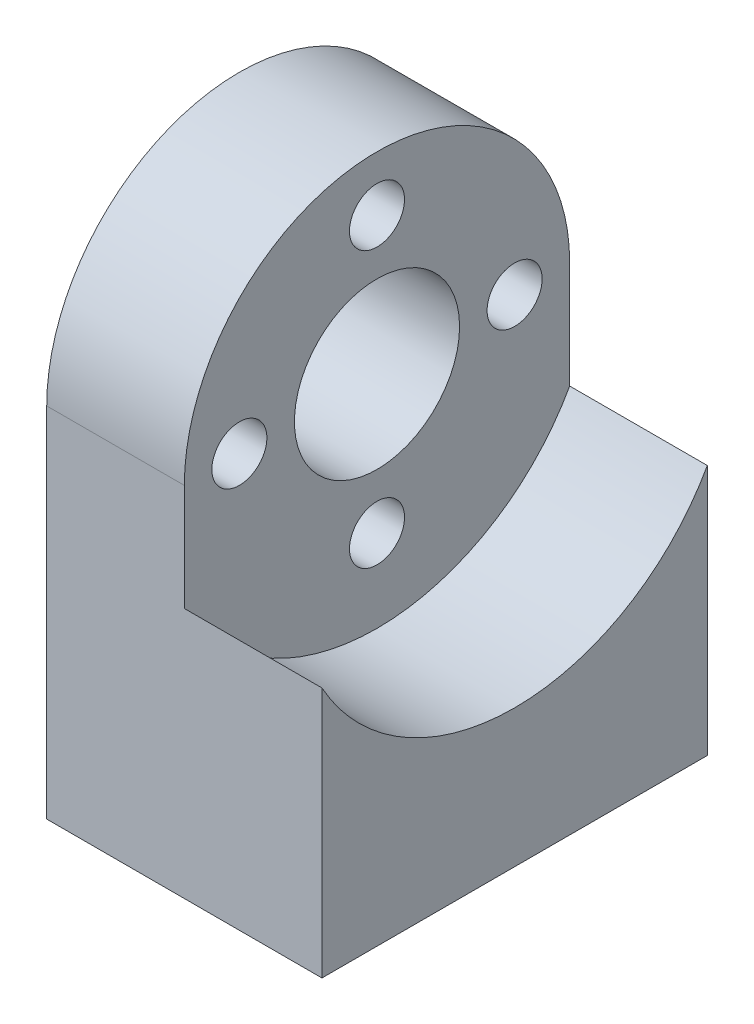
ISO-10303-21;
HEADER;
FILE_DESCRIPTION(('STEP AP214'),'2;1');
FILE_NAME('part.step','',(''),(''),'','','');
FILE_SCHEMA(('AUTOMOTIVE_DESIGN { 1 0 10303 214 1 1 1 1 }'));
ENDSEC;
DATA;
#1=APPLICATION_CONTEXT('core data for automotive mechanical design processes');
#2=APPLICATION_PROTOCOL_DEFINITION('international standard','automotive_design',2000,#1);
#3=PRODUCT_CONTEXT('',#1,'mechanical');
#4=PRODUCT('Part','Part','',(#3));
#5=PRODUCT_RELATED_PRODUCT_CATEGORY('part','',(#4));
#6=PRODUCT_DEFINITION_FORMATION('','',#4);
#7=PRODUCT_DEFINITION_CONTEXT('part definition',#1,'design');
#8=PRODUCT_DEFINITION('design','',#6,#7);
#9=PRODUCT_DEFINITION_SHAPE('','',#8);
#10=(LENGTH_UNIT() NAMED_UNIT(*) SI_UNIT(.MILLI.,.METRE.));
#11=(NAMED_UNIT(*) PLANE_ANGLE_UNIT() SI_UNIT($,.RADIAN.));
#12=(NAMED_UNIT(*) SI_UNIT($,.STERADIAN.) SOLID_ANGLE_UNIT());
#13=UNCERTAINTY_MEASURE_WITH_UNIT(LENGTH_MEASURE(1.E-05),#10,'distance_accuracy_value','');
#14=(GEOMETRIC_REPRESENTATION_CONTEXT(3) GLOBAL_UNCERTAINTY_ASSIGNED_CONTEXT((#13)) GLOBAL_UNIT_ASSIGNED_CONTEXT((#10,
#11,#12)) REPRESENTATION_CONTEXT('',''));
#15=CARTESIAN_POINT('',(0.,0.,0.));
#16=DIRECTION('',(0.,0.,1.));
#17=DIRECTION('',(1.,0.,0.));
#18=AXIS2_PLACEMENT_3D('',#15,#16,#17);
#19=CARTESIAN_POINT('',(0.,13.,-7.));
#20=DIRECTION('',(-1.,0.,0.));
#21=DIRECTION('',(0.,0.,1.));
#22=AXIS2_PLACEMENT_3D('',#19,#20,#21);
#23=PLANE('',#22);
#24=CARTESIAN_POINT('',(0.,13.,-7.));
#25=DIRECTION('',(1.,0.,0.));
#26=DIRECTION('',(0.,0.,1.));
#27=AXIS2_PLACEMENT_3D('',#24,#25,#26);
#28=CIRCLE('',#27,7.);
#29=CARTESIAN_POINT('',(0.,13.,-14.));
#30=VERTEX_POINT('',#29);
#31=CARTESIAN_POINT('',(0.,20.,-6.99999999999998));
#32=VERTEX_POINT('',#31);
#33=EDGE_CURVE('E161',#30,#32,#28,.T.);
#34=ORIENTED_EDGE('',*,*,#33,.F.);
#35=CARTESIAN_POINT('',(0.,13.,-12.));
#36=DIRECTION('',(-1.,0.,0.));
#37=DIRECTION('',(0.,0.,1.));
#38=AXIS2_PLACEMENT_3D('',#35,#36,#37);
#39=CIRCLE('',#38,2.00000000000001);
#40=CARTESIAN_POINT('',(0.,13.,-10.));
#41=VERTEX_POINT('',#40);
#42=EDGE_CURVE('E206',#30,#41,#39,.F.);
#43=ORIENTED_EDGE('',*,*,#42,.T.);
#44=CARTESIAN_POINT('',(0.,13.,-7.));
#45=DIRECTION('',(1.,0.,0.));
#46=DIRECTION('',(0.,0.,-1.));
#47=AXIS2_PLACEMENT_3D('',#44,#45,#46);
#48=CIRCLE('',#47,3.);
#49=CARTESIAN_POINT('',(0.,16.,-6.99999999999999));
#50=VERTEX_POINT('',#49);
#51=EDGE_CURVE('E148',#41,#50,#48,.T.);
#52=ORIENTED_EDGE('',*,*,#51,.T.);
#53=CARTESIAN_POINT('',(0.,18.,-6.99999999999999));
#54=DIRECTION('',(-1.,0.,0.));
#55=DIRECTION('',(0.,0.,1.));
#56=AXIS2_PLACEMENT_3D('',#53,#54,#55);
#57=CIRCLE('',#56,2.00000000000001);
#58=EDGE_CURVE('E50',#50,#32,#57,.F.);
#59=ORIENTED_EDGE('',*,*,#58,.T.);
#60=EDGE_LOOP('',(#34,#43,#52,#59));
#61=FACE_BOUND('',#60,.T.);
#62=ADVANCED_FACE('F35',(#61),#23,.T.);
#63=CARTESIAN_POINT('',(0.,13.,-4.));
#64=VERTEX_POINT('',#63);
#65=CARTESIAN_POINT('',(0.,10.,-7.00000000000003));
#66=VERTEX_POINT('',#65);
#67=EDGE_CURVE('E234',#64,#66,#48,.T.);
#68=ORIENTED_EDGE('',*,*,#67,.T.);
#69=CARTESIAN_POINT('',(0.,8.,-7.00000000000005));
#70=DIRECTION('',(-1.,0.,0.));
#71=DIRECTION('',(0.,0.,1.));
#72=AXIS2_PLACEMENT_3D('',#69,#70,#71);
#73=CIRCLE('',#72,2.00000000000001);
#74=EDGE_CURVE('E56',#66,#66,#73,.F.);
#75=ORIENTED_EDGE('',*,*,#74,.T.);
#76=EDGE_CURVE('E147',#66,#41,#48,.T.);
#77=ORIENTED_EDGE('',*,*,#76,.T.);
#78=CARTESIAN_POINT('',(0.,13.,-12.));
#79=DIRECTION('',(-1.,0.,0.));
#80=DIRECTION('',(0.,0.,1.));
#81=AXIS2_PLACEMENT_3D('',#78,#79,#80);
#82=CIRCLE('',#81,2.00000000000001);
#83=EDGE_CURVE('E204',#41,#30,#82,.F.);
#84=ORIENTED_EDGE('',*,*,#83,.T.);
#85=DIRECTION('',(0.,1.,0.));
#86=VECTOR('',#85,1.);
#87=CARTESIAN_POINT('',(0.,0.,-14.));
#88=LINE('',#87,#86);
#89=CARTESIAN_POINT('',(0.,0.,-14.));
#90=VERTEX_POINT('',#89);
#91=EDGE_CURVE('E155',#90,#30,#88,.T.);
#92=ORIENTED_EDGE('',*,*,#91,.F.);
#93=DIRECTION('',(0.,0.,-1.));
#94=VECTOR('',#93,1.);
#95=CARTESIAN_POINT('',(0.,0.,0.));
#96=LINE('',#95,#94);
#97=CARTESIAN_POINT('',(0.,0.,0.));
#98=VERTEX_POINT('',#97);
#99=EDGE_CURVE('E166',#98,#90,#96,.T.);
#100=ORIENTED_EDGE('',*,*,#99,.F.);
#101=DIRECTION('',(0.,-1.,0.));
#102=VECTOR('',#101,1.);
#103=CARTESIAN_POINT('',(0.,13.,0.));
#104=LINE('',#103,#102);
#105=CARTESIAN_POINT('',(0.,13.,0.));
#106=VERTEX_POINT('',#105);
#107=EDGE_CURVE('E164',#106,#98,#104,.T.);
#108=ORIENTED_EDGE('',*,*,#107,.F.);
#109=CARTESIAN_POINT('',(0.,13.,-2.));
#110=DIRECTION('',(-1.,0.,0.));
#111=DIRECTION('',(0.,0.,1.));
#112=AXIS2_PLACEMENT_3D('',#109,#110,#111);
#113=CIRCLE('',#112,2.00000000000001);
#114=EDGE_CURVE('E201',#106,#64,#113,.F.);
#115=ORIENTED_EDGE('',*,*,#114,.T.);
#116=EDGE_LOOP('',(#68,#75,#77,#84,#92,#100,#108,#115));
#117=FACE_BOUND('',#116,.T.);
#118=ADVANCED_FACE('F233',(#117),#23,.T.);
#119=CARTESIAN_POINT('',(10.,8.,-7.00000000000005));
#120=DIRECTION('',(-1.,0.,0.));
#121=DIRECTION('',(0.,1.,0.));
#122=AXIS2_PLACEMENT_3D('',#119,#120,#121);
#123=CYLINDRICAL_SURFACE('',#122,1.);
#124=CARTESIAN_POINT('',(1.,8.,-7.00000000000005));
#125=DIRECTION('',(-1.,0.,0.));
#126=DIRECTION('',(0.,0.,1.));
#127=AXIS2_PLACEMENT_3D('',#124,#125,#126);
#128=CIRCLE('',#127,1.);
#129=CARTESIAN_POINT('',(1.,8.,-6.00000000000005));
#130=VERTEX_POINT('',#129);
#131=EDGE_CURVE('E210',#130,#130,#128,.T.);
#132=ORIENTED_EDGE('',*,*,#131,.T.);
#133=EDGE_LOOP('',(#132));
#134=FACE_BOUND('',#133,.T.);
#135=CARTESIAN_POINT('',(5.,8.,-7.00000000000005));
#136=DIRECTION('',(1.,0.,0.));
#137=DIRECTION('',(0.,-1.,0.));
#138=AXIS2_PLACEMENT_3D('',#135,#136,#137);
#139=CIRCLE('',#138,1.);
#140=CARTESIAN_POINT('',(5.,6.99999999999999,-7.00000000000006));
#141=VERTEX_POINT('',#140);
#142=EDGE_CURVE('E192',#141,#141,#139,.T.);
#143=ORIENTED_EDGE('',*,*,#142,.T.);
#144=EDGE_LOOP('',(#143));
#145=FACE_BOUND('',#144,.T.);
#146=ADVANCED_FACE('F256',(#134,#145),#123,.F.);
#147=CARTESIAN_POINT('',(10.,13.,-2.));
#148=DIRECTION('',(-1.,0.,0.));
#149=DIRECTION('',(0.,0.,-1.));
#150=AXIS2_PLACEMENT_3D('',#147,#148,#149);
#151=CYLINDRICAL_SURFACE('',#150,1.);
#152=CARTESIAN_POINT('',(1.,13.,-2.));
#153=DIRECTION('',(-1.,0.,0.));
#154=DIRECTION('',(0.,0.,1.));
#155=AXIS2_PLACEMENT_3D('',#152,#153,#154);
#156=CIRCLE('',#155,1.);
#157=CARTESIAN_POINT('',(1.,13.,-0.999999999999999));
#158=VERTEX_POINT('',#157);
#159=EDGE_CURVE('E43',#158,#158,#156,.T.);
#160=ORIENTED_EDGE('',*,*,#159,.T.);
#161=EDGE_LOOP('',(#160));
#162=FACE_BOUND('',#161,.T.);
#163=CARTESIAN_POINT('',(5.,13.,-2.));
#164=DIRECTION('',(1.,0.,0.));
#165=DIRECTION('',(0.,0.,1.));
#166=AXIS2_PLACEMENT_3D('',#163,#164,#165);
#167=CIRCLE('',#166,1.);
#168=CARTESIAN_POINT('',(5.,13.,-0.999999999999999));
#169=VERTEX_POINT('',#168);
#170=EDGE_CURVE('E189',#169,#169,#167,.T.);
#171=ORIENTED_EDGE('',*,*,#170,.T.);
#172=EDGE_LOOP('',(#171));
#173=FACE_BOUND('',#172,.T.);
#174=ADVANCED_FACE('F218',(#162,#173),#151,.F.);
#175=CARTESIAN_POINT('',(10.,18.,-6.99999999999999));
#176=DIRECTION('',(-1.,0.,0.));
#177=DIRECTION('',(0.,-1.,0.));
#178=AXIS2_PLACEMENT_3D('',#175,#176,#177);
#179=CYLINDRICAL_SURFACE('',#178,1.);
#180=CARTESIAN_POINT('',(1.,18.,-6.99999999999999));
#181=DIRECTION('',(-1.,0.,0.));
#182=DIRECTION('',(0.,0.,1.));
#183=AXIS2_PLACEMENT_3D('',#180,#181,#182);
#184=CIRCLE('',#183,1.);
#185=CARTESIAN_POINT('',(1.,18.,-5.99999999999998));
#186=VERTEX_POINT('',#185);
#187=EDGE_CURVE('E11',#186,#186,#184,.T.);
#188=ORIENTED_EDGE('',*,*,#187,.T.);
#189=EDGE_LOOP('',(#188));
#190=FACE_BOUND('',#189,.T.);
#191=CARTESIAN_POINT('',(5.,18.,-6.99999999999999));
#192=DIRECTION('',(1.,0.,0.));
#193=DIRECTION('',(0.,1.,0.));
#194=AXIS2_PLACEMENT_3D('',#191,#192,#193);
#195=CIRCLE('',#194,1.);
#196=CARTESIAN_POINT('',(5.,19.,-6.99999999999998));
#197=VERTEX_POINT('',#196);
#198=EDGE_CURVE('E186',#197,#197,#195,.T.);
#199=ORIENTED_EDGE('',*,*,#198,.T.);
#200=EDGE_LOOP('',(#199));
#201=FACE_BOUND('',#200,.T.);
#202=ADVANCED_FACE('F373',(#190,#201),#179,.F.);
#203=CARTESIAN_POINT('',(10.,13.,-7.));
#204=DIRECTION('',(-1.,0.,0.));
#205=DIRECTION('',(0.,0.,1.));
#206=AXIS2_PLACEMENT_3D('',#203,#204,#205);
#207=CYLINDRICAL_SURFACE('',#206,7.);
#208=CARTESIAN_POINT('',(5.,13.,-7.));
#209=DIRECTION('',(1.,0.,0.));
#210=DIRECTION('',(0.,0.,-1.));
#211=AXIS2_PLACEMENT_3D('',#208,#209,#210);
#212=CIRCLE('',#211,7.);
#213=CARTESIAN_POINT('',(5.,13.,-14.));
#214=VERTEX_POINT('',#213);
#215=CARTESIAN_POINT('',(5.,13.,0.));
#216=VERTEX_POINT('',#215);
#217=EDGE_CURVE('E140',#214,#216,#212,.T.);
#218=ORIENTED_EDGE('',*,*,#217,.F.);
#219=DIRECTION('',(-1.,0.,0.));
#220=VECTOR('',#219,1.);
#221=CARTESIAN_POINT('',(10.,13.,-14.));
#222=LINE('',#221,#220);
#223=EDGE_CURVE('E160',#214,#30,#222,.T.);
#224=ORIENTED_EDGE('',*,*,#223,.T.);
#225=ORIENTED_EDGE('',*,*,#33,.T.);
#226=EDGE_CURVE('E150',#32,#106,#28,.T.);
#227=ORIENTED_EDGE('',*,*,#226,.T.);
#228=DIRECTION('',(-1.,0.,0.));
#229=VECTOR('',#228,1.);
#230=CARTESIAN_POINT('',(10.,13.,0.));
#231=LINE('',#230,#229);
#232=EDGE_CURVE('E178',#216,#106,#231,.T.);
#233=ORIENTED_EDGE('',*,*,#232,.F.);
#234=EDGE_LOOP('',(#218,#224,#225,#227,#233));
#235=FACE_BOUND('',#234,.T.);
#236=ADVANCED_FACE('F278',(#235),#207,.T.);
#237=CARTESIAN_POINT('',(10.,13.,-7.));
#238=DIRECTION('',(-1.,0.,0.));
#239=DIRECTION('',(0.,0.,1.));
#240=AXIS2_PLACEMENT_3D('',#237,#238,#239);
#241=CYLINDRICAL_SURFACE('',#240,3.);
#242=ORIENTED_EDGE('',*,*,#51,.F.);
#243=ORIENTED_EDGE('',*,*,#76,.F.);
#244=ORIENTED_EDGE('',*,*,#67,.F.);
#245=EDGE_CURVE('E151',#50,#64,#48,.T.);
#246=ORIENTED_EDGE('',*,*,#245,.F.);
#247=EDGE_LOOP('',(#242,#243,#244,#246));
#248=FACE_BOUND('',#247,.T.);
#249=CARTESIAN_POINT('',(5.,13.,-7.));
#250=DIRECTION('',(1.,0.,0.));
#251=DIRECTION('',(0.,0.,-1.));
#252=AXIS2_PLACEMENT_3D('',#249,#250,#251);
#253=CIRCLE('',#252,3.);
#254=CARTESIAN_POINT('',(5.,13.,-10.));
#255=VERTEX_POINT('',#254);
#256=EDGE_CURVE('E135',#255,#255,#253,.T.);
#257=ORIENTED_EDGE('',*,*,#256,.T.);
#258=EDGE_LOOP('',(#257));
#259=FACE_BOUND('',#258,.T.);
#260=ADVANCED_FACE('F240',(#248,#259),#241,.F.);
#261=CARTESIAN_POINT('',(10.,13.,-12.));
#262=DIRECTION('',(-1.,0.,0.));
#263=DIRECTION('',(0.,0.,1.));
#264=AXIS2_PLACEMENT_3D('',#261,#262,#263);
#265=CYLINDRICAL_SURFACE('',#264,1.);
#266=CARTESIAN_POINT('',(1.,13.,-12.));
#267=DIRECTION('',(-1.,0.,0.));
#268=DIRECTION('',(0.,0.,1.));
#269=AXIS2_PLACEMENT_3D('',#266,#267,#268);
#270=CIRCLE('',#269,1.);
#271=CARTESIAN_POINT('',(1.,13.,-11.));
#272=VERTEX_POINT('',#271);
#273=EDGE_CURVE('E213',#272,#272,#270,.T.);
#274=ORIENTED_EDGE('',*,*,#273,.T.);
#275=EDGE_LOOP('',(#274));
#276=FACE_BOUND('',#275,.T.);
#277=CARTESIAN_POINT('',(5.,13.,-12.));
#278=DIRECTION('',(1.,0.,0.));
#279=DIRECTION('',(0.,0.,-1.));
#280=AXIS2_PLACEMENT_3D('',#277,#278,#279);
#281=CIRCLE('',#280,1.);
#282=CARTESIAN_POINT('',(5.,13.,-13.));
#283=VERTEX_POINT('',#282);
#284=EDGE_CURVE('E133',#283,#283,#281,.T.);
#285=ORIENTED_EDGE('',*,*,#284,.T.);
#286=EDGE_LOOP('',(#285));
#287=FACE_BOUND('',#286,.T.);
#288=ADVANCED_FACE('F269',(#276,#287),#265,.F.);
#289=CARTESIAN_POINT('',(10.,13.,-7.));
#290=DIRECTION('',(-1.,0.,0.));
#291=DIRECTION('',(0.,0.,1.));
#292=AXIS2_PLACEMENT_3D('',#289,#290,#291);
#293=PLANE('',#292);
#294=DIRECTION('',(0.,1.,0.));
#295=VECTOR('',#294,1.);
#296=CARTESIAN_POINT('',(10.,0.,-14.));
#297=LINE('',#296,#295);
#298=CARTESIAN_POINT('',(10.,0.,-14.));
#299=VERTEX_POINT('',#298);
#300=CARTESIAN_POINT('',(10.,9.12701665379258,-14.));
#301=VERTEX_POINT('',#300);
#302=EDGE_CURVE('E157',#299,#301,#297,.T.);
#303=ORIENTED_EDGE('',*,*,#302,.T.);
#304=CARTESIAN_POINT('',(10.,13.,-7.));
#305=DIRECTION('',(1.,0.,0.));
#306=DIRECTION('',(0.,0.,-1.));
#307=AXIS2_PLACEMENT_3D('',#304,#305,#306);
#308=CIRCLE('',#307,8.);
#309=CARTESIAN_POINT('',(10.,9.12701665379258,0.));
#310=VERTEX_POINT('',#309);
#311=EDGE_CURVE('E130',#310,#301,#308,.T.);
#312=ORIENTED_EDGE('',*,*,#311,.F.);
#313=DIRECTION('',(0.,-1.,0.));
#314=VECTOR('',#313,1.);
#315=CARTESIAN_POINT('',(10.,13.,0.));
#316=LINE('',#315,#314);
#317=CARTESIAN_POINT('',(10.,0.,0.));
#318=VERTEX_POINT('',#317);
#319=EDGE_CURVE('E152',#310,#318,#316,.T.);
#320=ORIENTED_EDGE('',*,*,#319,.T.);
#321=DIRECTION('',(0.,0.,-1.));
#322=VECTOR('',#321,1.);
#323=CARTESIAN_POINT('',(10.,0.,0.));
#324=LINE('',#323,#322);
#325=EDGE_CURVE('E154',#318,#299,#324,.T.);
#326=ORIENTED_EDGE('',*,*,#325,.T.);
#327=EDGE_LOOP('',(#303,#312,#320,#326));
#328=FACE_BOUND('',#327,.T.);
#329=ADVANCED_FACE('F261',(#328),#293,.F.);
#330=ORIENTED_EDGE('',*,*,#245,.T.);
#331=CARTESIAN_POINT('',(0.,13.,-2.));
#332=DIRECTION('',(-1.,0.,0.));
#333=DIRECTION('',(0.,0.,1.));
#334=AXIS2_PLACEMENT_3D('',#331,#332,#333);
#335=CIRCLE('',#334,2.00000000000001);
#336=EDGE_CURVE('E199',#64,#106,#335,.F.);
#337=ORIENTED_EDGE('',*,*,#336,.T.);
#338=ORIENTED_EDGE('',*,*,#226,.F.);
#339=CARTESIAN_POINT('',(0.,18.,-6.99999999999999));
#340=DIRECTION('',(-1.,0.,0.));
#341=DIRECTION('',(0.,0.,1.));
#342=AXIS2_PLACEMENT_3D('',#339,#340,#341);
#343=CIRCLE('',#342,2.00000000000001);
#344=EDGE_CURVE('E196',#32,#50,#343,.F.);
#345=ORIENTED_EDGE('',*,*,#344,.T.);
#346=EDGE_LOOP('',(#330,#337,#338,#345));
#347=FACE_BOUND('',#346,.T.);
#348=ADVANCED_FACE('F243',(#347),#23,.T.);
#349=CARTESIAN_POINT('',(10.,13.,0.));
#350=DIRECTION('',(0.,0.,-1.));
#351=DIRECTION('',(0.,1.,0.));
#352=AXIS2_PLACEMENT_3D('',#349,#350,#351);
#353=PLANE('',#352);
#354=ORIENTED_EDGE('',*,*,#319,.F.);
#355=DIRECTION('',(1.,0.,0.));
#356=VECTOR('',#355,1.);
#357=CARTESIAN_POINT('',(5.,9.12701665379258,0.));
#358=LINE('',#357,#356);
#359=CARTESIAN_POINT('',(5.,9.12701665379258,0.));
#360=VERTEX_POINT('',#359);
#361=EDGE_CURVE('E144',#310,#360,#358,.F.);
#362=ORIENTED_EDGE('',*,*,#361,.T.);
#363=DIRECTION('',(0.,-1.,0.));
#364=VECTOR('',#363,1.);
#365=CARTESIAN_POINT('',(5.,13.,0.));
#366=LINE('',#365,#364);
#367=EDGE_CURVE('E142',#216,#360,#366,.T.);
#368=ORIENTED_EDGE('',*,*,#367,.F.);
#369=ORIENTED_EDGE('',*,*,#232,.T.);
#370=ORIENTED_EDGE('',*,*,#107,.T.);
#371=DIRECTION('',(-1.,0.,0.));
#372=VECTOR('',#371,1.);
#373=CARTESIAN_POINT('',(10.,0.,0.));
#374=LINE('',#373,#372);
#375=EDGE_CURVE('E175',#318,#98,#374,.T.);
#376=ORIENTED_EDGE('',*,*,#375,.F.);
#377=EDGE_LOOP('',(#354,#362,#368,#369,#370,#376));
#378=FACE_BOUND('',#377,.T.);
#379=ADVANCED_FACE('F260',(#378),#353,.F.);
#380=CARTESIAN_POINT('',(10.,0.,0.));
#381=DIRECTION('',(0.,1.,0.));
#382=DIRECTION('',(0.,0.,1.));
#383=AXIS2_PLACEMENT_3D('',#380,#381,#382);
#384=PLANE('',#383);
#385=CARTESIAN_POINT('',(7.,0.,-11.));
#386=DIRECTION('',(0.,-1.,0.));
#387=DIRECTION('',(0.,0.,-1.));
#388=AXIS2_PLACEMENT_3D('',#385,#386,#387);
#389=CIRCLE('',#388,1.);
#390=CARTESIAN_POINT('',(7.,0.,-12.));
#391=VERTEX_POINT('',#390);
#392=EDGE_CURVE('E323',#391,#391,#389,.T.);
#393=ORIENTED_EDGE('',*,*,#392,.F.);
#394=EDGE_LOOP('',(#393));
#395=FACE_BOUND('',#394,.T.);
#396=CARTESIAN_POINT('',(3.,0.,-3.));
#397=DIRECTION('',(0.,-1.,0.));
#398=DIRECTION('',(0.,0.,-1.));
#399=AXIS2_PLACEMENT_3D('',#396,#397,#398);
#400=CIRCLE('',#399,0.999999999999999);
#401=CARTESIAN_POINT('',(3.,0.,-4.));
#402=VERTEX_POINT('',#401);
#403=EDGE_CURVE('E322',#402,#402,#400,.T.);
#404=ORIENTED_EDGE('',*,*,#403,.F.);
#405=EDGE_LOOP('',(#404));
#406=FACE_BOUND('',#405,.T.);
#407=CARTESIAN_POINT('',(3.,0.,-11.));
#408=DIRECTION('',(0.,-1.,0.));
#409=DIRECTION('',(0.,0.,-1.));
#410=AXIS2_PLACEMENT_3D('',#407,#408,#409);
#411=CIRCLE('',#410,1.25);
#412=CARTESIAN_POINT('',(3.,0.,-12.25));
#413=VERTEX_POINT('',#412);
#414=EDGE_CURVE('E118',#413,#413,#411,.T.);
#415=ORIENTED_EDGE('',*,*,#414,.F.);
#416=EDGE_LOOP('',(#415));
#417=FACE_BOUND('',#416,.T.);
#418=CARTESIAN_POINT('',(7.,0.,-3.));
#419=DIRECTION('',(0.,-1.,0.));
#420=DIRECTION('',(0.,0.,-1.));
#421=AXIS2_PLACEMENT_3D('',#418,#419,#420);
#422=CIRCLE('',#421,1.25);
#423=CARTESIAN_POINT('',(7.,0.,-4.25));
#424=VERTEX_POINT('',#423);
#425=EDGE_CURVE('E117',#424,#424,#422,.T.);
#426=ORIENTED_EDGE('',*,*,#425,.F.);
#427=EDGE_LOOP('',(#426));
#428=FACE_BOUND('',#427,.T.);
#429=ORIENTED_EDGE('',*,*,#99,.T.);
#430=DIRECTION('',(-1.,0.,0.));
#431=VECTOR('',#430,1.);
#432=CARTESIAN_POINT('',(10.,0.,-14.));
#433=LINE('',#432,#431);
#434=EDGE_CURVE('E172',#299,#90,#433,.T.);
#435=ORIENTED_EDGE('',*,*,#434,.F.);
#436=ORIENTED_EDGE('',*,*,#325,.F.);
#437=ORIENTED_EDGE('',*,*,#375,.T.);
#438=EDGE_LOOP('',(#429,#435,#436,#437));
#439=FACE_BOUND('',#438,.T.);
#440=ADVANCED_FACE('F266',(#395,#406,#417,#428,#439),#384,.F.);
#441=CARTESIAN_POINT('',(10.,0.,-14.));
#442=DIRECTION('',(0.,0.,1.));
#443=DIRECTION('',(0.,-1.,0.));
#444=AXIS2_PLACEMENT_3D('',#441,#442,#443);
#445=PLANE('',#444);
#446=DIRECTION('',(0.,1.,0.));
#447=VECTOR('',#446,1.);
#448=CARTESIAN_POINT('',(5.,0.,-14.));
#449=LINE('',#448,#447);
#450=CARTESIAN_POINT('',(5.,9.12701665379258,-14.));
#451=VERTEX_POINT('',#450);
#452=EDGE_CURVE('E138',#451,#214,#449,.T.);
#453=ORIENTED_EDGE('',*,*,#452,.F.);
#454=DIRECTION('',(1.,0.,0.));
#455=VECTOR('',#454,1.);
#456=CARTESIAN_POINT('',(5.,9.12701665379258,-14.));
#457=LINE('',#456,#455);
#458=EDGE_CURVE('E181',#451,#301,#457,.T.);
#459=ORIENTED_EDGE('',*,*,#458,.T.);
#460=ORIENTED_EDGE('',*,*,#302,.F.);
#461=ORIENTED_EDGE('',*,*,#434,.T.);
#462=ORIENTED_EDGE('',*,*,#91,.T.);
#463=ORIENTED_EDGE('',*,*,#223,.F.);
#464=EDGE_LOOP('',(#453,#459,#460,#461,#462,#463));
#465=FACE_BOUND('',#464,.T.);
#466=ADVANCED_FACE('F284',(#465),#445,.F.);
#467=CARTESIAN_POINT('',(5.,13.,-7.));
#468=DIRECTION('',(1.,0.,0.));
#469=DIRECTION('',(0.,0.,-1.));
#470=AXIS2_PLACEMENT_3D('',#467,#468,#469);
#471=CYLINDRICAL_SURFACE('',#470,8.);
#472=ORIENTED_EDGE('',*,*,#311,.T.);
#473=ORIENTED_EDGE('',*,*,#458,.F.);
#474=CARTESIAN_POINT('',(5.,13.,-7.));
#475=DIRECTION('',(1.,0.,0.));
#476=DIRECTION('',(0.,0.,-1.));
#477=AXIS2_PLACEMENT_3D('',#474,#475,#476);
#478=CIRCLE('',#477,8.);
#479=EDGE_CURVE('E131',#360,#451,#478,.T.);
#480=ORIENTED_EDGE('',*,*,#479,.F.);
#481=ORIENTED_EDGE('',*,*,#361,.F.);
#482=EDGE_LOOP('',(#472,#473,#480,#481));
#483=FACE_BOUND('',#482,.T.);
#484=ADVANCED_FACE('F280',(#483),#471,.F.);
#485=CARTESIAN_POINT('',(5.,13.,-7.));
#486=DIRECTION('',(1.,0.,0.));
#487=DIRECTION('',(0.,0.,-1.));
#488=AXIS2_PLACEMENT_3D('',#485,#486,#487);
#489=PLANE('',#488);
#490=ORIENTED_EDGE('',*,*,#142,.F.);
#491=EDGE_LOOP('',(#490));
#492=FACE_BOUND('',#491,.T.);
#493=ORIENTED_EDGE('',*,*,#170,.F.);
#494=EDGE_LOOP('',(#493));
#495=FACE_BOUND('',#494,.T.);
#496=ORIENTED_EDGE('',*,*,#198,.F.);
#497=EDGE_LOOP('',(#496));
#498=FACE_BOUND('',#497,.T.);
#499=ORIENTED_EDGE('',*,*,#284,.F.);
#500=EDGE_LOOP('',(#499));
#501=FACE_BOUND('',#500,.T.);
#502=ORIENTED_EDGE('',*,*,#256,.F.);
#503=EDGE_LOOP('',(#502));
#504=FACE_BOUND('',#503,.T.);
#505=ORIENTED_EDGE('',*,*,#367,.T.);
#506=ORIENTED_EDGE('',*,*,#479,.T.);
#507=ORIENTED_EDGE('',*,*,#452,.T.);
#508=ORIENTED_EDGE('',*,*,#217,.T.);
#509=EDGE_LOOP('',(#505,#506,#507,#508));
#510=FACE_BOUND('',#509,.T.);
#511=ADVANCED_FACE('F283',(#492,#495,#498,#501,#504,#510),#489,.T.);
#512=CARTESIAN_POINT('',(7.,4.,-3.));
#513=DIRECTION('',(0.,-1.,0.));
#514=DIRECTION('',(0.,0.,-1.));
#515=AXIS2_PLACEMENT_3D('',#512,#513,#514);
#516=CONICAL_SURFACE('',#515,1.25,1.02974425867665);
#517=CARTESIAN_POINT('',(7.,4.75107577378445,-3.));
#518=VERTEX_POINT('',#517);
#519=VERTEX_LOOP('',#518);
#520=FACE_BOUND('',#519,.T.);
#521=CARTESIAN_POINT('',(7.,4.,-3.));
#522=DIRECTION('',(0.,-1.,0.));
#523=DIRECTION('',(0.,0.,-1.));
#524=AXIS2_PLACEMENT_3D('',#521,#522,#523);
#525=CIRCLE('',#524,1.25);
#526=CARTESIAN_POINT('',(7.,4.,-4.25));
#527=VERTEX_POINT('',#526);
#528=EDGE_CURVE('E121',#527,#527,#525,.T.);
#529=ORIENTED_EDGE('',*,*,#528,.T.);
#530=EDGE_LOOP('',(#529));
#531=FACE_BOUND('',#530,.T.);
#532=ADVANCED_FACE('F288',(#520,#531),#516,.F.);
#533=CARTESIAN_POINT('',(7.,0.,-3.));
#534=DIRECTION('',(0.,-1.,0.));
#535=DIRECTION('',(0.,0.,-1.));
#536=AXIS2_PLACEMENT_3D('',#533,#534,#535);
#537=CYLINDRICAL_SURFACE('',#536,1.25);
#538=ORIENTED_EDGE('',*,*,#528,.F.);
#539=EDGE_LOOP('',(#538));
#540=FACE_BOUND('',#539,.T.);
#541=ORIENTED_EDGE('',*,*,#425,.T.);
#542=EDGE_LOOP('',(#541));
#543=FACE_BOUND('',#542,.T.);
#544=ADVANCED_FACE('F111',(#540,#543),#537,.F.);
#545=CARTESIAN_POINT('',(3.,4.,-11.));
#546=DIRECTION('',(0.,-1.,0.));
#547=DIRECTION('',(0.,0.,-1.));
#548=AXIS2_PLACEMENT_3D('',#545,#546,#547);
#549=CONICAL_SURFACE('',#548,1.25,1.02974425867665);
#550=CARTESIAN_POINT('',(3.,4.75107577378445,-11.));
#551=VERTEX_POINT('',#550);
#552=VERTEX_LOOP('',#551);
#553=FACE_BOUND('',#552,.T.);
#554=CARTESIAN_POINT('',(3.,4.,-11.));
#555=DIRECTION('',(0.,-1.,0.));
#556=DIRECTION('',(0.,0.,-1.));
#557=AXIS2_PLACEMENT_3D('',#554,#555,#556);
#558=CIRCLE('',#557,1.25);
#559=CARTESIAN_POINT('',(3.,4.,-12.25));
#560=VERTEX_POINT('',#559);
#561=EDGE_CURVE('E115',#560,#560,#558,.T.);
#562=ORIENTED_EDGE('',*,*,#561,.T.);
#563=EDGE_LOOP('',(#562));
#564=FACE_BOUND('',#563,.T.);
#565=ADVANCED_FACE('F107',(#553,#564),#549,.F.);
#566=CARTESIAN_POINT('',(3.,0.,-11.));
#567=DIRECTION('',(0.,-1.,0.));
#568=DIRECTION('',(0.,0.,-1.));
#569=AXIS2_PLACEMENT_3D('',#566,#567,#568);
#570=CYLINDRICAL_SURFACE('',#569,1.25);
#571=ORIENTED_EDGE('',*,*,#561,.F.);
#572=EDGE_LOOP('',(#571));
#573=FACE_BOUND('',#572,.T.);
#574=ORIENTED_EDGE('',*,*,#414,.T.);
#575=EDGE_LOOP('',(#574));
#576=FACE_BOUND('',#575,.T.);
#577=ADVANCED_FACE('F110',(#573,#576),#570,.F.);
#578=CARTESIAN_POINT('',(3.,4.,-3.));
#579=DIRECTION('',(0.,-1.,0.));
#580=DIRECTION('',(0.,0.,-1.));
#581=AXIS2_PLACEMENT_3D('',#578,#579,#580);
#582=CYLINDRICAL_SURFACE('',#581,0.999999999999999);
#583=CARTESIAN_POINT('',(3.,4.,-3.));
#584=DIRECTION('',(0.,-1.,0.));
#585=DIRECTION('',(0.,0.,-1.));
#586=AXIS2_PLACEMENT_3D('',#583,#584,#585);
#587=CIRCLE('',#586,0.999999999999999);
#588=CARTESIAN_POINT('',(3.,4.,-4.));
#589=VERTEX_POINT('',#588);
#590=EDGE_CURVE('E124',#589,#589,#587,.T.);
#591=ORIENTED_EDGE('',*,*,#590,.F.);
#592=EDGE_LOOP('',(#591));
#593=FACE_BOUND('',#592,.T.);
#594=ORIENTED_EDGE('',*,*,#403,.T.);
#595=EDGE_LOOP('',(#594));
#596=FACE_BOUND('',#595,.T.);
#597=ADVANCED_FACE('F298',(#593,#596),#582,.F.);
#598=CARTESIAN_POINT('',(3.,4.,-3.));
#599=DIRECTION('',(0.,-1.,0.));
#600=DIRECTION('',(0.,0.,-1.));
#601=AXIS2_PLACEMENT_3D('',#598,#599,#600);
#602=PLANE('',#601);
#603=ORIENTED_EDGE('',*,*,#590,.T.);
#604=EDGE_LOOP('',(#603));
#605=FACE_BOUND('',#604,.T.);
#606=ADVANCED_FACE('F301',(#605),#602,.T.);
#607=CARTESIAN_POINT('',(7.,4.,-11.));
#608=DIRECTION('',(0.,-1.,0.));
#609=DIRECTION('',(0.,0.,-1.));
#610=AXIS2_PLACEMENT_3D('',#607,#608,#609);
#611=CYLINDRICAL_SURFACE('',#610,1.);
#612=CARTESIAN_POINT('',(7.,4.,-11.));
#613=DIRECTION('',(0.,-1.,0.));
#614=DIRECTION('',(0.,0.,-1.));
#615=AXIS2_PLACEMENT_3D('',#612,#613,#614);
#616=CIRCLE('',#615,1.);
#617=CARTESIAN_POINT('',(7.,4.,-12.));
#618=VERTEX_POINT('',#617);
#619=EDGE_CURVE('E321',#618,#618,#616,.T.);
#620=ORIENTED_EDGE('',*,*,#619,.F.);
#621=EDGE_LOOP('',(#620));
#622=FACE_BOUND('',#621,.T.);
#623=ORIENTED_EDGE('',*,*,#392,.T.);
#624=EDGE_LOOP('',(#623));
#625=FACE_BOUND('',#624,.T.);
#626=ADVANCED_FACE('F305',(#622,#625),#611,.F.);
#627=CARTESIAN_POINT('',(7.,4.,-11.));
#628=DIRECTION('',(0.,-1.,0.));
#629=DIRECTION('',(0.,0.,-1.));
#630=AXIS2_PLACEMENT_3D('',#627,#628,#629);
#631=PLANE('',#630);
#632=ORIENTED_EDGE('',*,*,#619,.T.);
#633=EDGE_LOOP('',(#632));
#634=FACE_BOUND('',#633,.T.);
#635=ADVANCED_FACE('F309',(#634),#631,.T.);
#636=CARTESIAN_POINT('',(0.,8.,-7.00000000000005));
#637=DIRECTION('',(-1.,0.,0.));
#638=DIRECTION('',(0.,0.,1.));
#639=AXIS2_PLACEMENT_3D('',#636,#637,#638);
#640=CONICAL_SURFACE('',#639,2.00000000000001,0.785398163397448);
#641=ORIENTED_EDGE('',*,*,#131,.F.);
#642=EDGE_LOOP('',(#641));
#643=FACE_BOUND('',#642,.T.);
#644=ORIENTED_EDGE('',*,*,#74,.F.);
#645=EDGE_LOOP('',(#644));
#646=FACE_BOUND('',#645,.T.);
#647=ADVANCED_FACE('F312',(#643,#646),#640,.F.);
#648=CARTESIAN_POINT('',(0.,13.,-12.));
#649=DIRECTION('',(-1.,0.,0.));
#650=DIRECTION('',(0.,0.,1.));
#651=AXIS2_PLACEMENT_3D('',#648,#649,#650);
#652=CONICAL_SURFACE('',#651,2.00000000000001,0.785398163397449);
#653=ORIENTED_EDGE('',*,*,#273,.F.);
#654=EDGE_LOOP('',(#653));
#655=FACE_BOUND('',#654,.T.);
#656=ORIENTED_EDGE('',*,*,#83,.F.);
#657=ORIENTED_EDGE('',*,*,#42,.F.);
#658=EDGE_LOOP('',(#656,#657));
#659=FACE_BOUND('',#658,.T.);
#660=ADVANCED_FACE('F224',(#655,#659),#652,.F.);
#661=CARTESIAN_POINT('',(0.,13.,-2.));
#662=DIRECTION('',(-1.,0.,0.));
#663=DIRECTION('',(0.,0.,1.));
#664=AXIS2_PLACEMENT_3D('',#661,#662,#663);
#665=CONICAL_SURFACE('',#664,2.00000000000001,0.785398163397448);
#666=ORIENTED_EDGE('',*,*,#159,.F.);
#667=EDGE_LOOP('',(#666));
#668=FACE_BOUND('',#667,.T.);
#669=ORIENTED_EDGE('',*,*,#336,.F.);
#670=ORIENTED_EDGE('',*,*,#114,.F.);
#671=EDGE_LOOP('',(#669,#670));
#672=FACE_BOUND('',#671,.T.);
#673=ADVANCED_FACE('F221',(#668,#672),#665,.F.);
#674=CARTESIAN_POINT('',(0.,18.,-6.99999999999999));
#675=DIRECTION('',(-1.,0.,0.));
#676=DIRECTION('',(0.,0.,1.));
#677=AXIS2_PLACEMENT_3D('',#674,#675,#676);
#678=CONICAL_SURFACE('',#677,2.00000000000001,0.785398163397448);
#679=ORIENTED_EDGE('',*,*,#187,.F.);
#680=EDGE_LOOP('',(#679));
#681=FACE_BOUND('',#680,.T.);
#682=ORIENTED_EDGE('',*,*,#58,.F.);
#683=ORIENTED_EDGE('',*,*,#344,.F.);
#684=EDGE_LOOP('',(#682,#683));
#685=FACE_BOUND('',#684,.T.);
#686=ADVANCED_FACE('F37',(#681,#685),#678,.F.);
#687=CLOSED_SHELL('',(#62,#118,#146,#174,#202,#236,#260,#288,#329,#348,#379,#440,#466,#484,#511,
#532,#544,#565,#577,#597,#606,#626,#635,#647,#660,#673,#686));
#688=MANIFOLD_SOLID_BREP('B2',#687);
#689=ADVANCED_BREP_SHAPE_REPRESENTATION('',(#18,#688),#14);
#690=SHAPE_DEFINITION_REPRESENTATION(#9,#689);
ENDSEC;
END-ISO-10303-21;
